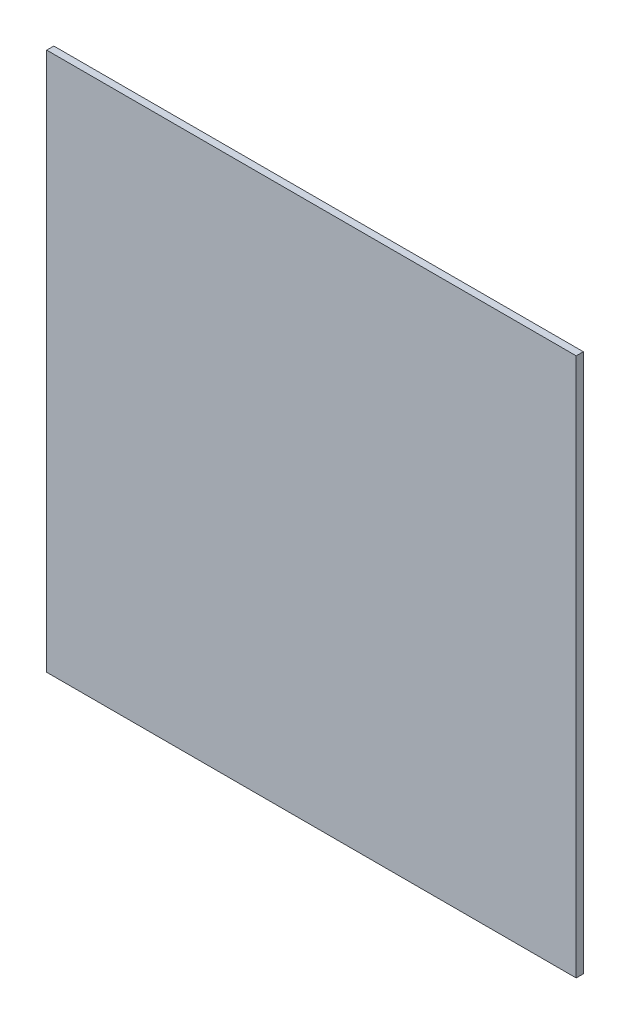
ISO-10303-21;
HEADER;
FILE_DESCRIPTION(('STEP AP214'),'2;1');
FILE_NAME('part.step','',(''),(''),'','','');
FILE_SCHEMA(('AUTOMOTIVE_DESIGN { 1 0 10303 214 1 1 1 1 }'));
ENDSEC;
DATA;
#1=APPLICATION_CONTEXT('core data for automotive mechanical design processes');
#2=APPLICATION_PROTOCOL_DEFINITION('international standard','automotive_design',2000,#1);
#3=PRODUCT_CONTEXT('',#1,'mechanical');
#4=PRODUCT('Part','Part','',(#3));
#5=PRODUCT_RELATED_PRODUCT_CATEGORY('part','',(#4));
#6=PRODUCT_DEFINITION_FORMATION('','',#4);
#7=PRODUCT_DEFINITION_CONTEXT('part definition',#1,'design');
#8=PRODUCT_DEFINITION('design','',#6,#7);
#9=PRODUCT_DEFINITION_SHAPE('','',#8);
#10=(LENGTH_UNIT() NAMED_UNIT(*) SI_UNIT(.MILLI.,.METRE.));
#11=(NAMED_UNIT(*) PLANE_ANGLE_UNIT() SI_UNIT($,.RADIAN.));
#12=(NAMED_UNIT(*) SI_UNIT($,.STERADIAN.) SOLID_ANGLE_UNIT());
#13=UNCERTAINTY_MEASURE_WITH_UNIT(LENGTH_MEASURE(1.E-05),#10,'distance_accuracy_value','');
#14=(GEOMETRIC_REPRESENTATION_CONTEXT(3) GLOBAL_UNCERTAINTY_ASSIGNED_CONTEXT((#13)) GLOBAL_UNIT_ASSIGNED_CONTEXT((#10,
#11,#12)) REPRESENTATION_CONTEXT('',''));
#15=CARTESIAN_POINT('',(0.,0.,0.));
#16=DIRECTION('',(0.,0.,1.));
#17=DIRECTION('',(1.,0.,0.));
#18=AXIS2_PLACEMENT_3D('',#15,#16,#17);
#19=CARTESIAN_POINT('',(0.,0.,6.35));
#20=DIRECTION('',(1.,0.,0.));
#21=DIRECTION('',(0.,1.,0.));
#22=AXIS2_PLACEMENT_3D('',#19,#20,#21);
#23=PLANE('',#22);
#24=DIRECTION('',(0.,-1.,0.));
#25=VECTOR('',#24,1.);
#26=CARTESIAN_POINT('',(0.,0.,0.));
#27=LINE('',#26,#25);
#28=CARTESIAN_POINT('',(0.,0.,0.));
#29=VERTEX_POINT('',#28);
#30=CARTESIAN_POINT('',(0.,-481.00261168,0.));
#31=VERTEX_POINT('',#30);
#32=EDGE_CURVE('E105',#29,#31,#27,.T.);
#33=ORIENTED_EDGE('',*,*,#32,.T.);
#34=DIRECTION('',(0.,0.,-1.));
#35=VECTOR('',#34,1.);
#36=CARTESIAN_POINT('',(0.,-481.00261168,6.35));
#37=LINE('',#36,#35);
#38=CARTESIAN_POINT('',(0.,-481.00261168,6.35));
#39=VERTEX_POINT('',#38);
#40=EDGE_CURVE('E11',#39,#31,#37,.T.);
#41=ORIENTED_EDGE('',*,*,#40,.F.);
#42=DIRECTION('',(0.,-1.,0.));
#43=VECTOR('',#42,1.);
#44=CARTESIAN_POINT('',(0.,0.,6.35));
#45=LINE('',#44,#43);
#46=CARTESIAN_POINT('',(0.,0.,6.35));
#47=VERTEX_POINT('',#46);
#48=EDGE_CURVE('E89',#47,#39,#45,.T.);
#49=ORIENTED_EDGE('',*,*,#48,.F.);
#50=DIRECTION('',(0.,0.,-1.));
#51=VECTOR('',#50,1.);
#52=CARTESIAN_POINT('',(0.,0.,6.35));
#53=LINE('',#52,#51);
#54=EDGE_CURVE('E98',#47,#29,#53,.T.);
#55=ORIENTED_EDGE('',*,*,#54,.T.);
#56=EDGE_LOOP('',(#33,#41,#49,#55));
#57=FACE_BOUND('',#56,.T.);
#58=ADVANCED_FACE('F39',(#57),#23,.F.);
#59=CARTESIAN_POINT('',(0.,-481.00261168,6.35));
#60=DIRECTION('',(0.,1.,0.));
#61=DIRECTION('',(0.,0.,1.));
#62=AXIS2_PLACEMENT_3D('',#59,#60,#61);
#63=PLANE('',#62);
#64=DIRECTION('',(1.,0.,0.));
#65=VECTOR('',#64,1.);
#66=CARTESIAN_POINT('',(0.,-481.00261168,0.));
#67=LINE('',#66,#65);
#68=CARTESIAN_POINT('',(472.69,-481.00261168,0.));
#69=VERTEX_POINT('',#68);
#70=EDGE_CURVE('E94',#31,#69,#67,.T.);
#71=ORIENTED_EDGE('',*,*,#70,.T.);
#72=DIRECTION('',(0.,0.,-1.));
#73=VECTOR('',#72,1.);
#74=CARTESIAN_POINT('',(472.69,-481.00261168,6.35));
#75=LINE('',#74,#73);
#76=CARTESIAN_POINT('',(472.69,-481.00261168,6.35));
#77=VERTEX_POINT('',#76);
#78=EDGE_CURVE('E50',#77,#69,#75,.T.);
#79=ORIENTED_EDGE('',*,*,#78,.F.);
#80=DIRECTION('',(1.,0.,0.));
#81=VECTOR('',#80,1.);
#82=CARTESIAN_POINT('',(0.,-481.00261168,6.35));
#83=LINE('',#82,#81);
#84=EDGE_CURVE('E83',#39,#77,#83,.T.);
#85=ORIENTED_EDGE('',*,*,#84,.F.);
#86=ORIENTED_EDGE('',*,*,#40,.T.);
#87=EDGE_LOOP('',(#71,#79,#85,#86));
#88=FACE_BOUND('',#87,.T.);
#89=ADVANCED_FACE('F91',(#88),#63,.F.);
#90=CARTESIAN_POINT('',(472.69,0.,6.35));
#91=DIRECTION('',(-1.,0.,0.));
#92=DIRECTION('',(0.,-1.,0.));
#93=AXIS2_PLACEMENT_3D('',#90,#91,#92);
#94=PLANE('',#93);
#95=DIRECTION('',(0.,1.,0.));
#96=VECTOR('',#95,1.);
#97=CARTESIAN_POINT('',(472.69,0.,0.));
#98=LINE('',#97,#96);
#99=CARTESIAN_POINT('',(472.69,0.,0.));
#100=VERTEX_POINT('',#99);
#101=EDGE_CURVE('E75',#69,#100,#98,.T.);
#102=ORIENTED_EDGE('',*,*,#101,.T.);
#103=DIRECTION('',(0.,0.,-1.));
#104=VECTOR('',#103,1.);
#105=CARTESIAN_POINT('',(472.69,0.,6.35));
#106=LINE('',#105,#104);
#107=CARTESIAN_POINT('',(472.69,0.,6.35));
#108=VERTEX_POINT('',#107);
#109=EDGE_CURVE('E92',#108,#100,#106,.T.);
#110=ORIENTED_EDGE('',*,*,#109,.F.);
#111=DIRECTION('',(0.,1.,0.));
#112=VECTOR('',#111,1.);
#113=CARTESIAN_POINT('',(472.69,0.,6.35));
#114=LINE('',#113,#112);
#115=EDGE_CURVE('E86',#77,#108,#114,.T.);
#116=ORIENTED_EDGE('',*,*,#115,.F.);
#117=ORIENTED_EDGE('',*,*,#78,.T.);
#118=EDGE_LOOP('',(#102,#110,#116,#117));
#119=FACE_BOUND('',#118,.T.);
#120=ADVANCED_FACE('F96',(#119),#94,.F.);
#121=CARTESIAN_POINT('',(0.,0.,6.35));
#122=DIRECTION('',(0.,-1.,0.));
#123=DIRECTION('',(0.,0.,-1.));
#124=AXIS2_PLACEMENT_3D('',#121,#122,#123);
#125=PLANE('',#124);
#126=DIRECTION('',(-1.,0.,0.));
#127=VECTOR('',#126,1.);
#128=CARTESIAN_POINT('',(0.,0.,0.));
#129=LINE('',#128,#127);
#130=EDGE_CURVE('E79',#100,#29,#129,.T.);
#131=ORIENTED_EDGE('',*,*,#130,.T.);
#132=ORIENTED_EDGE('',*,*,#54,.F.);
#133=DIRECTION('',(-1.,0.,0.));
#134=VECTOR('',#133,1.);
#135=CARTESIAN_POINT('',(0.,0.,6.35));
#136=LINE('',#135,#134);
#137=EDGE_CURVE('E54',#108,#47,#136,.T.);
#138=ORIENTED_EDGE('',*,*,#137,.F.);
#139=ORIENTED_EDGE('',*,*,#109,.T.);
#140=EDGE_LOOP('',(#131,#132,#138,#139));
#141=FACE_BOUND('',#140,.T.);
#142=ADVANCED_FACE('F108',(#141),#125,.F.);
#143=CARTESIAN_POINT('',(0.,0.,6.35));
#144=DIRECTION('',(0.,0.,1.));
#145=DIRECTION('',(1.,0.,0.));
#146=AXIS2_PLACEMENT_3D('',#143,#144,#145);
#147=PLANE('',#146);
#148=ORIENTED_EDGE('',*,*,#48,.T.);
#149=ORIENTED_EDGE('',*,*,#84,.T.);
#150=ORIENTED_EDGE('',*,*,#115,.T.);
#151=ORIENTED_EDGE('',*,*,#137,.T.);
#152=EDGE_LOOP('',(#148,#149,#150,#151));
#153=FACE_BOUND('',#152,.T.);
#154=ADVANCED_FACE('F88',(#153),#147,.T.);
#155=CARTESIAN_POINT('',(0.,0.,0.));
#156=DIRECTION('',(0.,0.,1.));
#157=DIRECTION('',(1.,0.,0.));
#158=AXIS2_PLACEMENT_3D('',#155,#156,#157);
#159=PLANE('',#158);
#160=ORIENTED_EDGE('',*,*,#32,.F.);
#161=ORIENTED_EDGE('',*,*,#130,.F.);
#162=ORIENTED_EDGE('',*,*,#101,.F.);
#163=ORIENTED_EDGE('',*,*,#70,.F.);
#164=EDGE_LOOP('',(#160,#161,#162,#163));
#165=FACE_BOUND('',#164,.T.);
#166=ADVANCED_FACE('F115',(#165),#159,.F.);
#167=CLOSED_SHELL('',(#58,#89,#120,#142,#154,#166));
#168=MANIFOLD_SOLID_BREP('B2',#167);
#169=ADVANCED_BREP_SHAPE_REPRESENTATION('',(#18,#168),#14);
#170=SHAPE_DEFINITION_REPRESENTATION(#9,#169);
ENDSEC;
END-ISO-10303-21;
